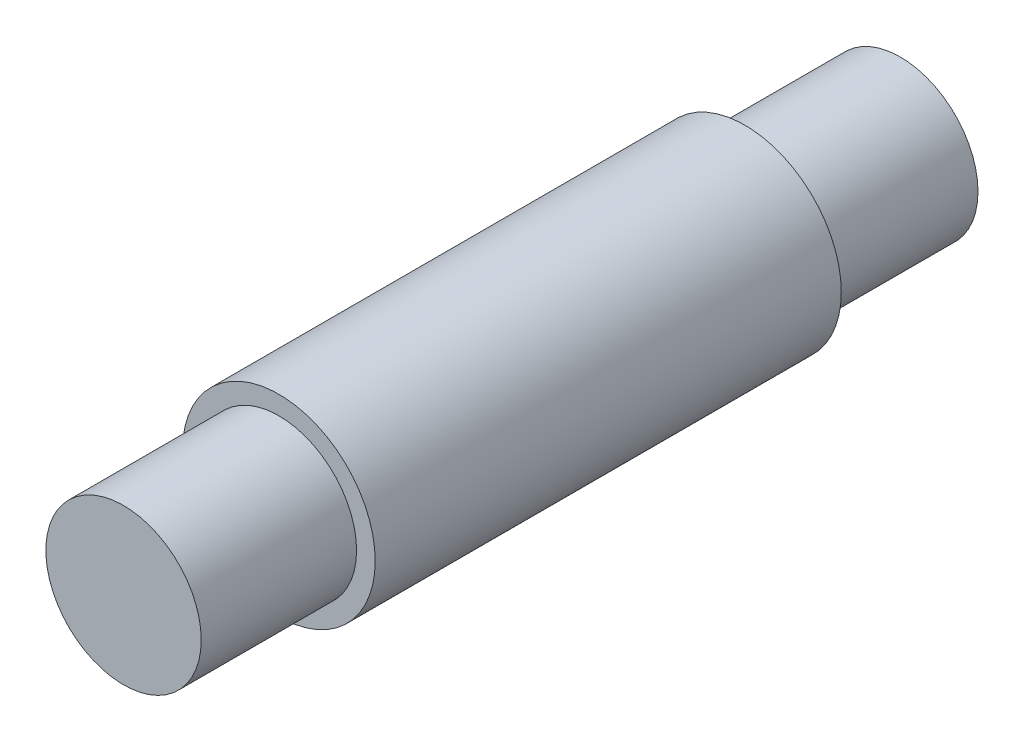
ISO-10303-21;
HEADER;
FILE_DESCRIPTION(('STEP AP214'),'2;1');
FILE_NAME('part.step','',(''),(''),'','','');
FILE_SCHEMA(('AUTOMOTIVE_DESIGN { 1 0 10303 214 1 1 1 1 }'));
ENDSEC;
DATA;
#1=APPLICATION_CONTEXT('core data for automotive mechanical design processes');
#2=APPLICATION_PROTOCOL_DEFINITION('international standard','automotive_design',2000,#1);
#3=PRODUCT_CONTEXT('',#1,'mechanical');
#4=PRODUCT('Part','Part','',(#3));
#5=PRODUCT_RELATED_PRODUCT_CATEGORY('part','',(#4));
#6=PRODUCT_DEFINITION_FORMATION('','',#4);
#7=PRODUCT_DEFINITION_CONTEXT('part definition',#1,'design');
#8=PRODUCT_DEFINITION('design','',#6,#7);
#9=PRODUCT_DEFINITION_SHAPE('','',#8);
#10=(LENGTH_UNIT() NAMED_UNIT(*) SI_UNIT(.MILLI.,.METRE.));
#11=(NAMED_UNIT(*) PLANE_ANGLE_UNIT() SI_UNIT($,.RADIAN.));
#12=(NAMED_UNIT(*) SI_UNIT($,.STERADIAN.) SOLID_ANGLE_UNIT());
#13=UNCERTAINTY_MEASURE_WITH_UNIT(LENGTH_MEASURE(1.E-05),#10,'distance_accuracy_value','');
#14=(GEOMETRIC_REPRESENTATION_CONTEXT(3) GLOBAL_UNCERTAINTY_ASSIGNED_CONTEXT((#13)) GLOBAL_UNIT_ASSIGNED_CONTEXT((#10,
#11,#12)) REPRESENTATION_CONTEXT('',''));
#15=CARTESIAN_POINT('',(0.,0.,0.));
#16=DIRECTION('',(0.,0.,1.));
#17=DIRECTION('',(1.,0.,0.));
#18=AXIS2_PLACEMENT_3D('',#15,#16,#17);
#19=CARTESIAN_POINT('',(0.,0.,3.75));
#20=DIRECTION('',(0.,0.,-1.));
#21=DIRECTION('',(-1.,0.,0.));
#22=AXIS2_PLACEMENT_3D('',#19,#20,#21);
#23=CYLINDRICAL_SURFACE('',#22,1.55);
#24=CARTESIAN_POINT('',(0.,0.,3.75));
#25=DIRECTION('',(0.,0.,1.));
#26=DIRECTION('',(1.,0.,0.));
#27=AXIS2_PLACEMENT_3D('',#24,#25,#26);
#28=CIRCLE('',#27,1.55);
#29=CARTESIAN_POINT('',(1.55,0.,3.75));
#30=VERTEX_POINT('',#29);
#31=EDGE_CURVE('E40',#30,#30,#28,.T.);
#32=ORIENTED_EDGE('',*,*,#31,.F.);
#33=EDGE_LOOP('',(#32));
#34=FACE_BOUND('',#33,.T.);
#35=CARTESIAN_POINT('',(0.,0.,-3.75));
#36=DIRECTION('',(0.,0.,1.));
#37=DIRECTION('',(1.,0.,0.));
#38=AXIS2_PLACEMENT_3D('',#35,#36,#37);
#39=CIRCLE('',#38,1.55);
#40=CARTESIAN_POINT('',(1.55,0.,-3.75));
#41=VERTEX_POINT('',#40);
#42=EDGE_CURVE('E55',#41,#41,#39,.T.);
#43=ORIENTED_EDGE('',*,*,#42,.T.);
#44=EDGE_LOOP('',(#43));
#45=FACE_BOUND('',#44,.T.);
#46=ADVANCED_FACE('F37',(#34,#45),#23,.T.);
#47=CARTESIAN_POINT('',(0.,0.,3.75));
#48=DIRECTION('',(0.,0.,1.));
#49=DIRECTION('',(1.,0.,0.));
#50=AXIS2_PLACEMENT_3D('',#47,#48,#49);
#51=PLANE('',#50);
#52=CARTESIAN_POINT('',(0.,0.,3.75));
#53=DIRECTION('',(0.,0.,1.));
#54=DIRECTION('',(1.,0.,0.));
#55=AXIS2_PLACEMENT_3D('',#52,#53,#54);
#56=CIRCLE('',#55,1.25);
#57=CARTESIAN_POINT('',(1.25,0.,3.75));
#58=VERTEX_POINT('',#57);
#59=EDGE_CURVE('E10',#58,#58,#56,.T.);
#60=ORIENTED_EDGE('',*,*,#59,.F.);
#61=EDGE_LOOP('',(#60));
#62=FACE_BOUND('',#61,.T.);
#63=ORIENTED_EDGE('',*,*,#31,.T.);
#64=EDGE_LOOP('',(#63));
#65=FACE_BOUND('',#64,.T.);
#66=ADVANCED_FACE('F79',(#62,#65),#51,.T.);
#67=CARTESIAN_POINT('',(0.,0.,6.25));
#68=DIRECTION('',(0.,0.,-1.));
#69=DIRECTION('',(-1.,0.,0.));
#70=AXIS2_PLACEMENT_3D('',#67,#68,#69);
#71=CYLINDRICAL_SURFACE('',#70,1.25);
#72=CARTESIAN_POINT('',(0.,0.,6.25));
#73=DIRECTION('',(0.,0.,1.));
#74=DIRECTION('',(1.,0.,0.));
#75=AXIS2_PLACEMENT_3D('',#72,#73,#74);
#76=CIRCLE('',#75,1.25);
#77=CARTESIAN_POINT('',(1.25,0.,6.25));
#78=VERTEX_POINT('',#77);
#79=EDGE_CURVE('E49',#78,#78,#76,.T.);
#80=ORIENTED_EDGE('',*,*,#79,.F.);
#81=EDGE_LOOP('',(#80));
#82=FACE_BOUND('',#81,.T.);
#83=ORIENTED_EDGE('',*,*,#59,.T.);
#84=EDGE_LOOP('',(#83));
#85=FACE_BOUND('',#84,.T.);
#86=ADVANCED_FACE('F84',(#82,#85),#71,.T.);
#87=CARTESIAN_POINT('',(0.,0.,6.25));
#88=DIRECTION('',(0.,0.,1.));
#89=DIRECTION('',(1.,0.,0.));
#90=AXIS2_PLACEMENT_3D('',#87,#88,#89);
#91=PLANE('',#90);
#92=ORIENTED_EDGE('',*,*,#79,.T.);
#93=EDGE_LOOP('',(#92));
#94=FACE_BOUND('',#93,.T.);
#95=ADVANCED_FACE('F91',(#94),#91,.T.);
#96=CARTESIAN_POINT('',(0.,0.,-3.75));
#97=DIRECTION('',(0.,0.,-1.));
#98=DIRECTION('',(1.,0.,0.));
#99=AXIS2_PLACEMENT_3D('',#96,#97,#98);
#100=PLANE('',#99);
#101=CARTESIAN_POINT('',(0.,0.,-3.75));
#102=DIRECTION('',(0.,0.,1.));
#103=DIRECTION('',(1.,0.,0.));
#104=AXIS2_PLACEMENT_3D('',#101,#102,#103);
#105=CIRCLE('',#104,1.25);
#106=CARTESIAN_POINT('',(1.25,0.,-3.75));
#107=VERTEX_POINT('',#106);
#108=EDGE_CURVE('E54',#107,#107,#105,.T.);
#109=ORIENTED_EDGE('',*,*,#108,.T.);
#110=EDGE_LOOP('',(#109));
#111=FACE_BOUND('',#110,.T.);
#112=ORIENTED_EDGE('',*,*,#42,.F.);
#113=EDGE_LOOP('',(#112));
#114=FACE_BOUND('',#113,.T.);
#115=ADVANCED_FACE('F76',(#111,#114),#100,.T.);
#116=CARTESIAN_POINT('',(0.,0.,-6.25));
#117=DIRECTION('',(0.,0.,1.));
#118=DIRECTION('',(-1.,0.,0.));
#119=AXIS2_PLACEMENT_3D('',#116,#117,#118);
#120=CYLINDRICAL_SURFACE('',#119,1.25);
#121=CARTESIAN_POINT('',(0.,0.,-6.25));
#122=DIRECTION('',(0.,0.,1.));
#123=DIRECTION('',(1.,0.,0.));
#124=AXIS2_PLACEMENT_3D('',#121,#122,#123);
#125=CIRCLE('',#124,1.25);
#126=CARTESIAN_POINT('',(1.25,0.,-6.25));
#127=VERTEX_POINT('',#126);
#128=EDGE_CURVE('E59',#127,#127,#125,.T.);
#129=ORIENTED_EDGE('',*,*,#128,.T.);
#130=EDGE_LOOP('',(#129));
#131=FACE_BOUND('',#130,.T.);
#132=ORIENTED_EDGE('',*,*,#108,.F.);
#133=EDGE_LOOP('',(#132));
#134=FACE_BOUND('',#133,.T.);
#135=ADVANCED_FACE('F67',(#131,#134),#120,.T.);
#136=CARTESIAN_POINT('',(0.,0.,-6.25));
#137=DIRECTION('',(0.,0.,-1.));
#138=DIRECTION('',(1.,0.,0.));
#139=AXIS2_PLACEMENT_3D('',#136,#137,#138);
#140=PLANE('',#139);
#141=ORIENTED_EDGE('',*,*,#128,.F.);
#142=EDGE_LOOP('',(#141));
#143=FACE_BOUND('',#142,.T.);
#144=ADVANCED_FACE('F70',(#143),#140,.T.);
#145=CLOSED_SHELL('',(#46,#66,#86,#95,#115,#135,#144));
#146=MANIFOLD_SOLID_BREP('B2',#145);
#147=ADVANCED_BREP_SHAPE_REPRESENTATION('',(#18,#146),#14);
#148=SHAPE_DEFINITION_REPRESENTATION(#9,#147);
ENDSEC;
END-ISO-10303-21;
